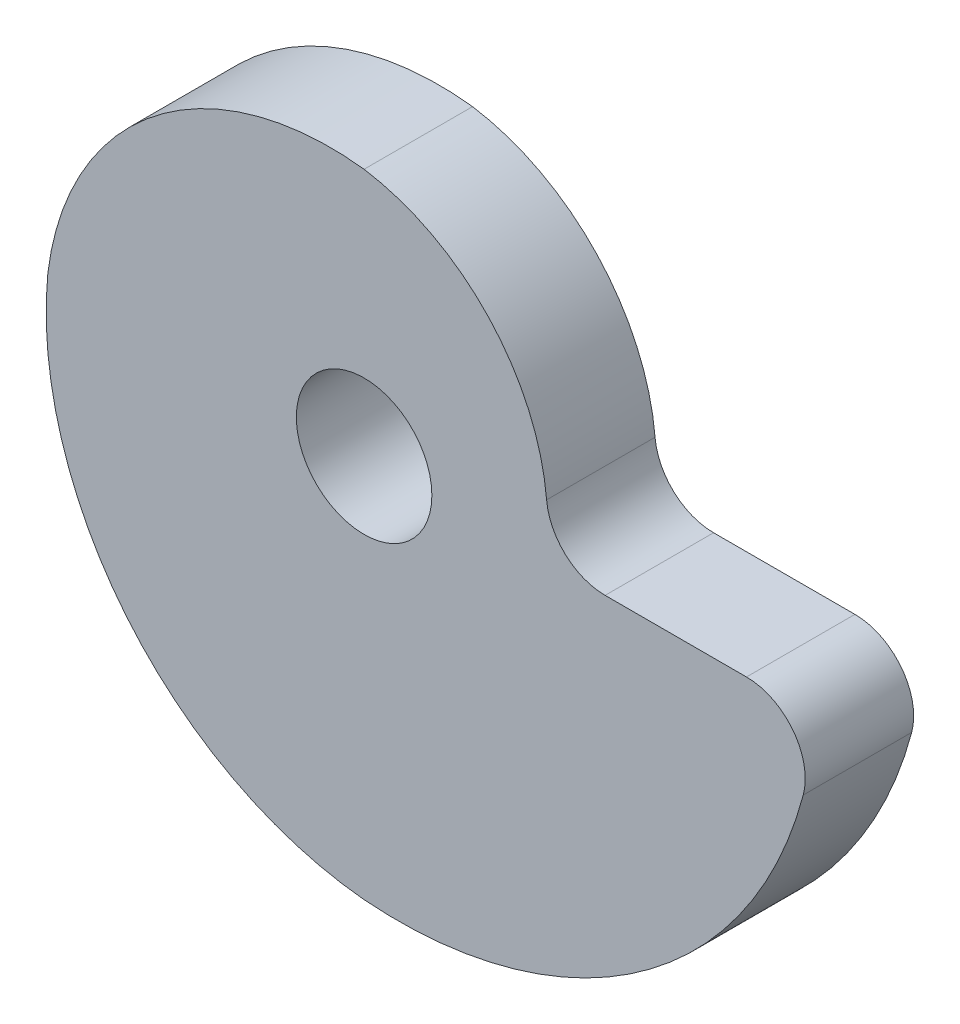
ISO-10303-21;
HEADER;
FILE_DESCRIPTION(('STEP AP214'),'2;1');
FILE_NAME('part.step','',(''),(''),'','','');
FILE_SCHEMA(('AUTOMOTIVE_DESIGN { 1 0 10303 214 1 1 1 1 }'));
ENDSEC;
DATA;
#1=APPLICATION_CONTEXT('core data for automotive mechanical design processes');
#2=APPLICATION_PROTOCOL_DEFINITION('international standard','automotive_design',2000,#1);
#3=PRODUCT_CONTEXT('',#1,'mechanical');
#4=PRODUCT('Part','Part','',(#3));
#5=PRODUCT_RELATED_PRODUCT_CATEGORY('part','',(#4));
#6=PRODUCT_DEFINITION_FORMATION('','',#4);
#7=PRODUCT_DEFINITION_CONTEXT('part definition',#1,'design');
#8=PRODUCT_DEFINITION('design','',#6,#7);
#9=PRODUCT_DEFINITION_SHAPE('','',#8);
#10=(LENGTH_UNIT() NAMED_UNIT(*) SI_UNIT(.MILLI.,.METRE.));
#11=(NAMED_UNIT(*) PLANE_ANGLE_UNIT() SI_UNIT($,.RADIAN.));
#12=(NAMED_UNIT(*) SI_UNIT($,.STERADIAN.) SOLID_ANGLE_UNIT());
#13=UNCERTAINTY_MEASURE_WITH_UNIT(LENGTH_MEASURE(1.E-05),#10,'distance_accuracy_value','');
#14=(GEOMETRIC_REPRESENTATION_CONTEXT(3) GLOBAL_UNCERTAINTY_ASSIGNED_CONTEXT((#13)) GLOBAL_UNIT_ASSIGNED_CONTEXT((#10,
#11,#12)) REPRESENTATION_CONTEXT('',''));
#15=CARTESIAN_POINT('',(0.,0.,0.));
#16=DIRECTION('',(0.,0.,1.));
#17=DIRECTION('',(1.,0.,0.));
#18=AXIS2_PLACEMENT_3D('',#15,#16,#17);
#19=CARTESIAN_POINT('',(1.49999999999997,1.50000000000003,2.4));
#20=DIRECTION('',(0.,0.,1.));
#21=DIRECTION('',(1.,0.,0.));
#22=AXIS2_PLACEMENT_3D('',#19,#20,#21);
#23=PLANE('',#22);
#24=CARTESIAN_POINT('',(1.49999999999997,1.50000000000003,2.4));
#25=DIRECTION('',(0.,0.,1.));
#26=DIRECTION('',(1.,0.,0.));
#27=AXIS2_PLACEMENT_3D('',#24,#25,#26);
#28=CIRCLE('',#27,18.5607111932706);
#29=CARTESIAN_POINT('',(0.,-17.,2.4));
#30=VERTEX_POINT('',#29);
#31=CARTESIAN_POINT('',(19.4378712390505,-3.26789003766289,2.4));
#32=VERTEX_POINT('',#31);
#33=EDGE_CURVE('E136',#30,#32,#28,.T.);
#34=ORIENTED_EDGE('',*,*,#33,.T.);
#35=CARTESIAN_POINT('',(16.9251191825215,-2.6,2.4));
#36=DIRECTION('',(0.,0.,1.));
#37=DIRECTION('',(1.,0.,0.));
#38=AXIS2_PLACEMENT_3D('',#35,#36,#37);
#39=CIRCLE('',#38,2.6);
#40=CARTESIAN_POINT('',(16.9251191825215,0.,2.4));
#41=VERTEX_POINT('',#40);
#42=EDGE_CURVE('E147',#32,#41,#39,.T.);
#43=ORIENTED_EDGE('',*,*,#42,.T.);
#44=DIRECTION('',(-1.,0.,0.));
#45=VECTOR('',#44,1.);
#46=CARTESIAN_POINT('',(8.,0.,2.4));
#47=LINE('',#46,#45);
#48=CARTESIAN_POINT('',(10.6680729189279,0.,2.4));
#49=VERTEX_POINT('',#48);
#50=EDGE_CURVE('E104',#41,#49,#47,.T.);
#51=ORIENTED_EDGE('',*,*,#50,.T.);
#52=CARTESIAN_POINT('',(10.6680729189279,2.6,2.4));
#53=DIRECTION('',(0.,0.,1.));
#54=DIRECTION('',(1.,0.,0.));
#55=AXIS2_PLACEMENT_3D('',#52,#53,#54);
#56=CIRCLE('',#55,2.6);
#57=CARTESIAN_POINT('',(8.07863217108732,2.3659132352672,2.4));
#58=VERTEX_POINT('',#57);
#59=EDGE_CURVE('E11',#49,#58,#56,.F.);
#60=ORIENTED_EDGE('',*,*,#59,.T.);
#61=CARTESIAN_POINT('',(-1.50000000000001,1.49999999999999,2.4));
#62=DIRECTION('',(0.,0.,1.));
#63=DIRECTION('',(1.,0.,0.));
#64=AXIS2_PLACEMENT_3D('',#61,#62,#63);
#65=CIRCLE('',#64,9.61769203083568);
#66=CARTESIAN_POINT('',(0.,11.,2.4));
#67=VERTEX_POINT('',#66);
#68=EDGE_CURVE('E95',#58,#67,#65,.T.);
#69=ORIENTED_EDGE('',*,*,#68,.T.);
#70=CARTESIAN_POINT('',(-1.49999999999999,-1.50000000000002,2.4));
#71=DIRECTION('',(0.,0.,1.));
#72=DIRECTION('',(1.,0.,0.));
#73=AXIS2_PLACEMENT_3D('',#70,#71,#72);
#74=CIRCLE('',#73,12.5896783120142);
#75=CARTESIAN_POINT('',(-14.,0.,2.4));
#76=VERTEX_POINT('',#75);
#77=EDGE_CURVE('E99',#67,#76,#74,.T.);
#78=ORIENTED_EDGE('',*,*,#77,.T.);
#79=CARTESIAN_POINT('',(1.50000000000001,-1.5,2.4));
#80=DIRECTION('',(0.,0.,1.));
#81=DIRECTION('',(1.,0.,0.));
#82=AXIS2_PLACEMENT_3D('',#79,#80,#81);
#83=CIRCLE('',#82,15.5724115023974);
#84=EDGE_CURVE('E119',#76,#30,#83,.T.);
#85=ORIENTED_EDGE('',*,*,#84,.T.);
#86=EDGE_LOOP('',(#34,#43,#51,#60,#69,#78,#85));
#87=FACE_BOUND('',#86,.T.);
#88=CARTESIAN_POINT('',(0.,0.,2.4));
#89=DIRECTION('',(0.,0.,1.));
#90=DIRECTION('',(1.,0.,0.));
#91=AXIS2_PLACEMENT_3D('',#88,#89,#90);
#92=CIRCLE('',#91,3.);
#93=CARTESIAN_POINT('',(3.,0.,2.4));
#94=VERTEX_POINT('',#93);
#95=EDGE_CURVE('E128',#94,#94,#92,.T.);
#96=ORIENTED_EDGE('',*,*,#95,.F.);
#97=EDGE_LOOP('',(#96));
#98=FACE_BOUND('',#97,.T.);
#99=ADVANCED_FACE('F38',(#87,#98),#23,.T.);
#100=CARTESIAN_POINT('',(1.49999999999997,1.50000000000003,-2.4));
#101=DIRECTION('',(0.,0.,1.));
#102=DIRECTION('',(1.,0.,0.));
#103=AXIS2_PLACEMENT_3D('',#100,#101,#102);
#104=PLANE('',#103);
#105=DIRECTION('',(-1.,0.,0.));
#106=VECTOR('',#105,1.);
#107=CARTESIAN_POINT('',(8.,0.,-2.4));
#108=LINE('',#107,#106);
#109=CARTESIAN_POINT('',(16.9251191825215,0.,-2.4));
#110=VERTEX_POINT('',#109);
#111=CARTESIAN_POINT('',(10.6680729189279,0.,-2.4));
#112=VERTEX_POINT('',#111);
#113=EDGE_CURVE('E127',#110,#112,#108,.T.);
#114=ORIENTED_EDGE('',*,*,#113,.F.);
#115=CARTESIAN_POINT('',(16.9251191825215,-2.6,-2.4));
#116=DIRECTION('',(0.,0.,1.));
#117=DIRECTION('',(1.,0.,0.));
#118=AXIS2_PLACEMENT_3D('',#115,#116,#117);
#119=CIRCLE('',#118,2.6);
#120=CARTESIAN_POINT('',(19.4378712390505,-3.26789003766289,-2.4));
#121=VERTEX_POINT('',#120);
#122=EDGE_CURVE('E144',#110,#121,#119,.F.);
#123=ORIENTED_EDGE('',*,*,#122,.T.);
#124=CARTESIAN_POINT('',(1.49999999999997,1.50000000000003,-2.4));
#125=DIRECTION('',(0.,0.,1.));
#126=DIRECTION('',(1.,0.,0.));
#127=AXIS2_PLACEMENT_3D('',#124,#125,#126);
#128=CIRCLE('',#127,18.5607111932706);
#129=CARTESIAN_POINT('',(0.,-17.,-2.4));
#130=VERTEX_POINT('',#129);
#131=EDGE_CURVE('E125',#130,#121,#128,.T.);
#132=ORIENTED_EDGE('',*,*,#131,.F.);
#133=CARTESIAN_POINT('',(1.50000000000001,-1.5,-2.4));
#134=DIRECTION('',(0.,0.,1.));
#135=DIRECTION('',(1.,0.,0.));
#136=AXIS2_PLACEMENT_3D('',#133,#134,#135);
#137=CIRCLE('',#136,15.5724115023974);
#138=CARTESIAN_POINT('',(-14.,0.,-2.4));
#139=VERTEX_POINT('',#138);
#140=EDGE_CURVE('E134',#139,#130,#137,.T.);
#141=ORIENTED_EDGE('',*,*,#140,.F.);
#142=CARTESIAN_POINT('',(-1.49999999999999,-1.50000000000002,-2.4));
#143=DIRECTION('',(0.,0.,1.));
#144=DIRECTION('',(1.,0.,0.));
#145=AXIS2_PLACEMENT_3D('',#142,#143,#144);
#146=CIRCLE('',#145,12.5896783120142);
#147=CARTESIAN_POINT('',(0.,11.,-2.4));
#148=VERTEX_POINT('',#147);
#149=EDGE_CURVE('E132',#148,#139,#146,.T.);
#150=ORIENTED_EDGE('',*,*,#149,.F.);
#151=CARTESIAN_POINT('',(-1.50000000000001,1.49999999999999,-2.4));
#152=DIRECTION('',(0.,0.,1.));
#153=DIRECTION('',(1.,0.,0.));
#154=AXIS2_PLACEMENT_3D('',#151,#152,#153);
#155=CIRCLE('',#154,9.61769203083568);
#156=CARTESIAN_POINT('',(8.07863217108732,2.3659132352672,-2.4));
#157=VERTEX_POINT('',#156);
#158=EDGE_CURVE('E110',#157,#148,#155,.T.);
#159=ORIENTED_EDGE('',*,*,#158,.F.);
#160=CARTESIAN_POINT('',(10.6680729189279,2.6,-2.4));
#161=DIRECTION('',(0.,0.,1.));
#162=DIRECTION('',(1.,0.,0.));
#163=AXIS2_PLACEMENT_3D('',#160,#161,#162);
#164=CIRCLE('',#163,2.6);
#165=EDGE_CURVE('E46',#157,#112,#164,.T.);
#166=ORIENTED_EDGE('',*,*,#165,.T.);
#167=EDGE_LOOP('',(#114,#123,#132,#141,#150,#159,#166));
#168=FACE_BOUND('',#167,.T.);
#169=CARTESIAN_POINT('',(0.,0.,-2.4));
#170=DIRECTION('',(0.,0.,1.));
#171=DIRECTION('',(1.,0.,0.));
#172=AXIS2_PLACEMENT_3D('',#169,#170,#171);
#173=CIRCLE('',#172,3.);
#174=CARTESIAN_POINT('',(3.,0.,-2.4));
#175=VERTEX_POINT('',#174);
#176=EDGE_CURVE('E196',#175,#175,#173,.T.);
#177=ORIENTED_EDGE('',*,*,#176,.T.);
#178=EDGE_LOOP('',(#177));
#179=FACE_BOUND('',#178,.T.);
#180=ADVANCED_FACE('F152',(#168,#179),#104,.F.);
#181=CARTESIAN_POINT('',(1.49999999999997,1.50000000000003,2.4));
#182=DIRECTION('',(0.,0.,-1.));
#183=DIRECTION('',(-1.,0.,0.));
#184=AXIS2_PLACEMENT_3D('',#181,#182,#183);
#185=CYLINDRICAL_SURFACE('',#184,18.5607111932706);
#186=ORIENTED_EDGE('',*,*,#131,.T.);
#187=DIRECTION('',(0.,0.,-1.));
#188=VECTOR('',#187,1.);
#189=CARTESIAN_POINT('',(19.4378712390505,-3.26789003766289,2.4));
#190=LINE('',#189,#188);
#191=EDGE_CURVE('E59',#121,#32,#190,.F.);
#192=ORIENTED_EDGE('',*,*,#191,.T.);
#193=ORIENTED_EDGE('',*,*,#33,.F.);
#194=DIRECTION('',(0.,0.,-1.));
#195=VECTOR('',#194,1.);
#196=CARTESIAN_POINT('',(0.,-17.,2.4));
#197=LINE('',#196,#195);
#198=EDGE_CURVE('E121',#30,#130,#197,.T.);
#199=ORIENTED_EDGE('',*,*,#198,.T.);
#200=EDGE_LOOP('',(#186,#192,#193,#199));
#201=FACE_BOUND('',#200,.T.);
#202=ADVANCED_FACE('F173',(#201),#185,.T.);
#203=CARTESIAN_POINT('',(8.,0.,2.4));
#204=DIRECTION('',(0.,-1.,0.));
#205=DIRECTION('',(0.,0.,-1.));
#206=AXIS2_PLACEMENT_3D('',#203,#204,#205);
#207=PLANE('',#206);
#208=ORIENTED_EDGE('',*,*,#50,.F.);
#209=DIRECTION('',(0.,0.,-1.));
#210=VECTOR('',#209,1.);
#211=CARTESIAN_POINT('',(16.9251191825215,0.,2.4));
#212=LINE('',#211,#210);
#213=EDGE_CURVE('E141',#41,#110,#212,.T.);
#214=ORIENTED_EDGE('',*,*,#213,.T.);
#215=ORIENTED_EDGE('',*,*,#113,.T.);
#216=DIRECTION('',(0.,0.,1.));
#217=VECTOR('',#216,1.);
#218=CARTESIAN_POINT('',(10.6680729189279,0.,2.4));
#219=LINE('',#218,#217);
#220=EDGE_CURVE('E113',#112,#49,#219,.T.);
#221=ORIENTED_EDGE('',*,*,#220,.T.);
#222=EDGE_LOOP('',(#208,#214,#215,#221));
#223=FACE_BOUND('',#222,.T.);
#224=ADVANCED_FACE('F158',(#223),#207,.F.);
#225=CARTESIAN_POINT('',(-1.50000000000001,1.49999999999999,2.4));
#226=DIRECTION('',(0.,0.,-1.));
#227=DIRECTION('',(-1.,0.,0.));
#228=AXIS2_PLACEMENT_3D('',#225,#226,#227);
#229=CYLINDRICAL_SURFACE('',#228,9.61769203083568);
#230=ORIENTED_EDGE('',*,*,#68,.F.);
#231=DIRECTION('',(0.,0.,-1.));
#232=VECTOR('',#231,1.);
#233=CARTESIAN_POINT('',(8.07863217108732,2.3659132352672,2.4));
#234=LINE('',#233,#232);
#235=EDGE_CURVE('E149',#58,#157,#234,.T.);
#236=ORIENTED_EDGE('',*,*,#235,.T.);
#237=ORIENTED_EDGE('',*,*,#158,.T.);
#238=DIRECTION('',(0.,0.,-1.));
#239=VECTOR('',#238,1.);
#240=CARTESIAN_POINT('',(0.,11.,2.4));
#241=LINE('',#240,#239);
#242=EDGE_CURVE('E107',#67,#148,#241,.T.);
#243=ORIENTED_EDGE('',*,*,#242,.F.);
#244=EDGE_LOOP('',(#230,#236,#237,#243));
#245=FACE_BOUND('',#244,.T.);
#246=ADVANCED_FACE('F108',(#245),#229,.T.);
#247=CARTESIAN_POINT('',(-1.49999999999999,-1.50000000000002,2.4));
#248=DIRECTION('',(0.,0.,-1.));
#249=DIRECTION('',(-1.,0.,0.));
#250=AXIS2_PLACEMENT_3D('',#247,#248,#249);
#251=CYLINDRICAL_SURFACE('',#250,12.5896783120142);
#252=ORIENTED_EDGE('',*,*,#149,.T.);
#253=DIRECTION('',(0.,0.,-1.));
#254=VECTOR('',#253,1.);
#255=CARTESIAN_POINT('',(-14.,0.,2.4));
#256=LINE('',#255,#254);
#257=EDGE_CURVE('E114',#76,#139,#256,.T.);
#258=ORIENTED_EDGE('',*,*,#257,.F.);
#259=ORIENTED_EDGE('',*,*,#77,.F.);
#260=ORIENTED_EDGE('',*,*,#242,.T.);
#261=EDGE_LOOP('',(#252,#258,#259,#260));
#262=FACE_BOUND('',#261,.T.);
#263=ADVANCED_FACE('F116',(#262),#251,.T.);
#264=CARTESIAN_POINT('',(1.50000000000001,-1.5,2.4));
#265=DIRECTION('',(0.,0.,-1.));
#266=DIRECTION('',(-1.,0.,0.));
#267=AXIS2_PLACEMENT_3D('',#264,#265,#266);
#268=CYLINDRICAL_SURFACE('',#267,15.5724115023974);
#269=ORIENTED_EDGE('',*,*,#140,.T.);
#270=ORIENTED_EDGE('',*,*,#198,.F.);
#271=ORIENTED_EDGE('',*,*,#84,.F.);
#272=ORIENTED_EDGE('',*,*,#257,.T.);
#273=EDGE_LOOP('',(#269,#270,#271,#272));
#274=FACE_BOUND('',#273,.T.);
#275=ADVANCED_FACE('F177',(#274),#268,.T.);
#276=CARTESIAN_POINT('',(0.,0.,2.4));
#277=DIRECTION('',(0.,0.,-1.));
#278=DIRECTION('',(-1.,0.,0.));
#279=AXIS2_PLACEMENT_3D('',#276,#277,#278);
#280=CYLINDRICAL_SURFACE('',#279,3.);
#281=ORIENTED_EDGE('',*,*,#95,.T.);
#282=EDGE_LOOP('',(#281));
#283=FACE_BOUND('',#282,.T.);
#284=ORIENTED_EDGE('',*,*,#176,.F.);
#285=EDGE_LOOP('',(#284));
#286=FACE_BOUND('',#285,.T.);
#287=ADVANCED_FACE('F165',(#283,#286),#280,.F.);
#288=CARTESIAN_POINT('',(16.9251191825215,-2.6,2.4));
#289=DIRECTION('',(0.,0.,-1.));
#290=DIRECTION('',(-1.,0.,0.));
#291=AXIS2_PLACEMENT_3D('',#288,#289,#290);
#292=CYLINDRICAL_SURFACE('',#291,2.6);
#293=ORIENTED_EDGE('',*,*,#42,.F.);
#294=ORIENTED_EDGE('',*,*,#191,.F.);
#295=ORIENTED_EDGE('',*,*,#122,.F.);
#296=ORIENTED_EDGE('',*,*,#213,.F.);
#297=EDGE_LOOP('',(#293,#294,#295,#296));
#298=FACE_BOUND('',#297,.T.);
#299=ADVANCED_FACE('F161',(#298),#292,.T.);
#300=CARTESIAN_POINT('',(10.6680729189279,2.6,2.4));
#301=DIRECTION('',(0.,0.,-1.));
#302=DIRECTION('',(-1.,0.,0.));
#303=AXIS2_PLACEMENT_3D('',#300,#301,#302);
#304=CYLINDRICAL_SURFACE('',#303,2.6);
#305=ORIENTED_EDGE('',*,*,#59,.F.);
#306=ORIENTED_EDGE('',*,*,#220,.F.);
#307=ORIENTED_EDGE('',*,*,#165,.F.);
#308=ORIENTED_EDGE('',*,*,#235,.F.);
#309=EDGE_LOOP('',(#305,#306,#307,#308));
#310=FACE_BOUND('',#309,.T.);
#311=ADVANCED_FACE('F40',(#310),#304,.F.);
#312=CLOSED_SHELL('',(#99,#180,#202,#224,#246,#263,#275,#287,#299,#311));
#313=MANIFOLD_SOLID_BREP('B2',#312);
#314=ADVANCED_BREP_SHAPE_REPRESENTATION('',(#18,#313),#14);
#315=SHAPE_DEFINITION_REPRESENTATION(#9,#314);
ENDSEC;
END-ISO-10303-21;
